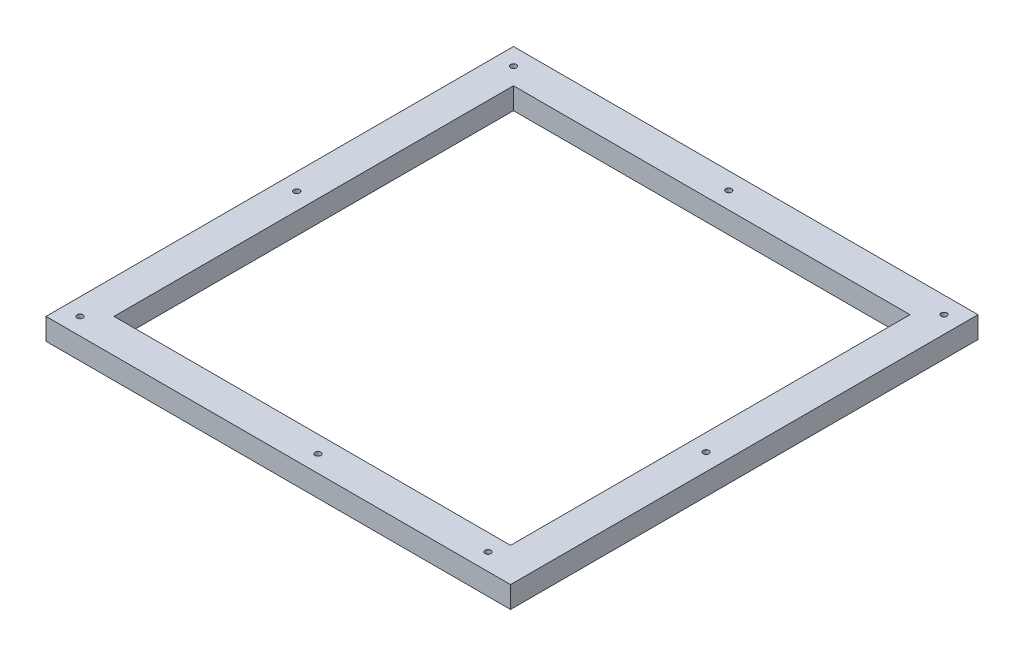
ISO-10303-21;
HEADER;
FILE_DESCRIPTION(('STEP AP214'),'2;1');
FILE_NAME('part.step','',(''),(''),'','','');
FILE_SCHEMA(('AUTOMOTIVE_DESIGN { 1 0 10303 214 1 1 1 1 }'));
ENDSEC;
DATA;
#1=APPLICATION_CONTEXT('core data for automotive mechanical design processes');
#2=APPLICATION_PROTOCOL_DEFINITION('international standard','automotive_design',2000,#1);
#3=PRODUCT_CONTEXT('',#1,'mechanical');
#4=PRODUCT('Part','Part','',(#3));
#5=PRODUCT_RELATED_PRODUCT_CATEGORY('part','',(#4));
#6=PRODUCT_DEFINITION_FORMATION('','',#4);
#7=PRODUCT_DEFINITION_CONTEXT('part definition',#1,'design');
#8=PRODUCT_DEFINITION('design','',#6,#7);
#9=PRODUCT_DEFINITION_SHAPE('','',#8);
#10=(LENGTH_UNIT() NAMED_UNIT(*) SI_UNIT(.MILLI.,.METRE.));
#11=(NAMED_UNIT(*) PLANE_ANGLE_UNIT() SI_UNIT($,.RADIAN.));
#12=(NAMED_UNIT(*) SI_UNIT($,.STERADIAN.) SOLID_ANGLE_UNIT());
#13=UNCERTAINTY_MEASURE_WITH_UNIT(LENGTH_MEASURE(1.E-05),#10,'distance_accuracy_value','');
#14=(GEOMETRIC_REPRESENTATION_CONTEXT(3) GLOBAL_UNCERTAINTY_ASSIGNED_CONTEXT((#13)) GLOBAL_UNIT_ASSIGNED_CONTEXT((#10,
#11,#12)) REPRESENTATION_CONTEXT('',''));
#15=CARTESIAN_POINT('',(0.,0.,0.));
#16=DIRECTION('',(0.,0.,1.));
#17=DIRECTION('',(1.,0.,0.));
#18=AXIS2_PLACEMENT_3D('',#15,#16,#17);
#19=CARTESIAN_POINT('',(136.635,12.7,-137.5));
#20=DIRECTION('',(-1.,0.,0.));
#21=DIRECTION('',(0.,0.,1.));
#22=AXIS2_PLACEMENT_3D('',#19,#20,#21);
#23=PLANE('',#22);
#24=DIRECTION('',(0.,0.,-1.));
#25=VECTOR('',#24,1.);
#26=CARTESIAN_POINT('',(136.635,0.,-137.5));
#27=LINE('',#26,#25);
#28=CARTESIAN_POINT('',(136.635,0.,137.5));
#29=VERTEX_POINT('',#28);
#30=CARTESIAN_POINT('',(136.635,0.,-137.5));
#31=VERTEX_POINT('',#30);
#32=EDGE_CURVE('E155',#29,#31,#27,.T.);
#33=ORIENTED_EDGE('',*,*,#32,.T.);
#34=DIRECTION('',(0.,-1.,0.));
#35=VECTOR('',#34,1.);
#36=CARTESIAN_POINT('',(136.635,12.7,-137.5));
#37=LINE('',#36,#35);
#38=CARTESIAN_POINT('',(136.635,12.7,-137.5));
#39=VERTEX_POINT('',#38);
#40=EDGE_CURVE('E11',#39,#31,#37,.T.);
#41=ORIENTED_EDGE('',*,*,#40,.F.);
#42=DIRECTION('',(0.,0.,-1.));
#43=VECTOR('',#42,1.);
#44=CARTESIAN_POINT('',(136.635,12.7,-137.5));
#45=LINE('',#44,#43);
#46=CARTESIAN_POINT('',(136.635,12.7,137.5));
#47=VERTEX_POINT('',#46);
#48=EDGE_CURVE('E161',#47,#39,#45,.T.);
#49=ORIENTED_EDGE('',*,*,#48,.F.);
#50=DIRECTION('',(0.,-1.,0.));
#51=VECTOR('',#50,1.);
#52=CARTESIAN_POINT('',(136.635,12.7,137.5));
#53=LINE('',#52,#51);
#54=EDGE_CURVE('E175',#47,#29,#53,.T.);
#55=ORIENTED_EDGE('',*,*,#54,.T.);
#56=EDGE_LOOP('',(#33,#41,#49,#55));
#57=FACE_BOUND('',#56,.T.);
#58=ADVANCED_FACE('F44',(#57),#23,.F.);
#59=CARTESIAN_POINT('',(-136.635,12.7,-137.5));
#60=DIRECTION('',(0.,0.,1.));
#61=DIRECTION('',(1.,0.,0.));
#62=AXIS2_PLACEMENT_3D('',#59,#60,#61);
#63=PLANE('',#62);
#64=DIRECTION('',(-1.,0.,0.));
#65=VECTOR('',#64,1.);
#66=CARTESIAN_POINT('',(-136.635,0.,-137.5));
#67=LINE('',#66,#65);
#68=CARTESIAN_POINT('',(-136.635,0.,-137.5));
#69=VERTEX_POINT('',#68);
#70=EDGE_CURVE('E179',#31,#69,#67,.T.);
#71=ORIENTED_EDGE('',*,*,#70,.T.);
#72=DIRECTION('',(0.,-1.,0.));
#73=VECTOR('',#72,1.);
#74=CARTESIAN_POINT('',(-136.635,12.7,-137.5));
#75=LINE('',#74,#73);
#76=CARTESIAN_POINT('',(-136.635,12.7,-137.5));
#77=VERTEX_POINT('',#76);
#78=EDGE_CURVE('E52',#77,#69,#75,.T.);
#79=ORIENTED_EDGE('',*,*,#78,.F.);
#80=DIRECTION('',(-1.,0.,0.));
#81=VECTOR('',#80,1.);
#82=CARTESIAN_POINT('',(-136.635,12.7,-137.5));
#83=LINE('',#82,#81);
#84=EDGE_CURVE('E165',#39,#77,#83,.T.);
#85=ORIENTED_EDGE('',*,*,#84,.F.);
#86=ORIENTED_EDGE('',*,*,#40,.T.);
#87=EDGE_LOOP('',(#71,#79,#85,#86));
#88=FACE_BOUND('',#87,.T.);
#89=ADVANCED_FACE('F213',(#88),#63,.F.);
#90=CARTESIAN_POINT('',(-136.635,12.7,-137.5));
#91=DIRECTION('',(1.,0.,0.));
#92=DIRECTION('',(0.,0.,-1.));
#93=AXIS2_PLACEMENT_3D('',#90,#91,#92);
#94=PLANE('',#93);
#95=DIRECTION('',(0.,0.,1.));
#96=VECTOR('',#95,1.);
#97=CARTESIAN_POINT('',(-136.635,0.,-137.5));
#98=LINE('',#97,#96);
#99=CARTESIAN_POINT('',(-136.635,0.,137.5));
#100=VERTEX_POINT('',#99);
#101=EDGE_CURVE('E182',#69,#100,#98,.T.);
#102=ORIENTED_EDGE('',*,*,#101,.T.);
#103=DIRECTION('',(0.,-1.,0.));
#104=VECTOR('',#103,1.);
#105=CARTESIAN_POINT('',(-136.635,12.7,137.5));
#106=LINE('',#105,#104);
#107=CARTESIAN_POINT('',(-136.635,12.7,137.5));
#108=VERTEX_POINT('',#107);
#109=EDGE_CURVE('E190',#108,#100,#106,.T.);
#110=ORIENTED_EDGE('',*,*,#109,.F.);
#111=DIRECTION('',(0.,0.,1.));
#112=VECTOR('',#111,1.);
#113=CARTESIAN_POINT('',(-136.635,12.7,-137.5));
#114=LINE('',#113,#112);
#115=EDGE_CURVE('E169',#77,#108,#114,.T.);
#116=ORIENTED_EDGE('',*,*,#115,.F.);
#117=ORIENTED_EDGE('',*,*,#78,.T.);
#118=EDGE_LOOP('',(#102,#110,#116,#117));
#119=FACE_BOUND('',#118,.T.);
#120=ADVANCED_FACE('F199',(#119),#94,.F.);
#121=CARTESIAN_POINT('',(-136.635,12.7,137.5));
#122=DIRECTION('',(0.,0.,-1.));
#123=DIRECTION('',(-1.,0.,0.));
#124=AXIS2_PLACEMENT_3D('',#121,#122,#123);
#125=PLANE('',#124);
#126=DIRECTION('',(1.,0.,0.));
#127=VECTOR('',#126,1.);
#128=CARTESIAN_POINT('',(-136.635,0.,137.5));
#129=LINE('',#128,#127);
#130=EDGE_CURVE('E166',#100,#29,#129,.T.);
#131=ORIENTED_EDGE('',*,*,#130,.T.);
#132=ORIENTED_EDGE('',*,*,#54,.F.);
#133=DIRECTION('',(1.,0.,0.));
#134=VECTOR('',#133,1.);
#135=CARTESIAN_POINT('',(-136.635,12.7,137.5));
#136=LINE('',#135,#134);
#137=EDGE_CURVE('E172',#108,#47,#136,.T.);
#138=ORIENTED_EDGE('',*,*,#137,.F.);
#139=ORIENTED_EDGE('',*,*,#109,.T.);
#140=EDGE_LOOP('',(#131,#132,#138,#139));
#141=FACE_BOUND('',#140,.T.);
#142=ADVANCED_FACE('F206',(#141),#125,.F.);
#143=CARTESIAN_POINT('',(0.,12.7,0.));
#144=DIRECTION('',(0.,1.,0.));
#145=DIRECTION('',(0.,0.,1.));
#146=AXIS2_PLACEMENT_3D('',#143,#144,#145);
#147=PLANE('',#146);
#148=CARTESIAN_POINT('',(-126.631099999995,12.7,127.5));
#149=DIRECTION('',(0.,1.,0.));
#150=DIRECTION('',(0.,0.,1.));
#151=AXIS2_PLACEMENT_3D('',#148,#149,#150);
#152=CIRCLE('',#151,1.725);
#153=CARTESIAN_POINT('',(-126.631099999995,12.7,129.225));
#154=VERTEX_POINT('',#153);
#155=EDGE_CURVE('E311',#154,#154,#152,.T.);
#156=ORIENTED_EDGE('',*,*,#155,.F.);
#157=EDGE_LOOP('',(#156));
#158=FACE_BOUND('',#157,.T.);
#159=CARTESIAN_POINT('',(0.,12.7,-127.5));
#160=DIRECTION('',(0.,1.,0.));
#161=DIRECTION('',(0.,0.,1.));
#162=AXIS2_PLACEMENT_3D('',#159,#160,#161);
#163=CIRCLE('',#162,1.725);
#164=CARTESIAN_POINT('',(0.,12.7,-125.775));
#165=VERTEX_POINT('',#164);
#166=EDGE_CURVE('E321',#165,#165,#163,.T.);
#167=ORIENTED_EDGE('',*,*,#166,.F.);
#168=EDGE_LOOP('',(#167));
#169=FACE_BOUND('',#168,.T.);
#170=CARTESIAN_POINT('',(-126.635,12.7,-127.5));
#171=DIRECTION('',(0.,1.,0.));
#172=DIRECTION('',(0.,0.,1.));
#173=AXIS2_PLACEMENT_3D('',#170,#171,#172);
#174=CIRCLE('',#173,1.725);
#175=CARTESIAN_POINT('',(-126.635,12.7,-125.775));
#176=VERTEX_POINT('',#175);
#177=EDGE_CURVE('E333',#176,#176,#174,.T.);
#178=ORIENTED_EDGE('',*,*,#177,.F.);
#179=EDGE_LOOP('',(#178));
#180=FACE_BOUND('',#179,.T.);
#181=CARTESIAN_POINT('',(126.632800000004,12.7,-127.5));
#182=DIRECTION('',(0.,1.,0.));
#183=DIRECTION('',(0.,0.,1.));
#184=AXIS2_PLACEMENT_3D('',#181,#182,#183);
#185=CIRCLE('',#184,1.725);
#186=CARTESIAN_POINT('',(126.632800000004,12.7,-125.775));
#187=VERTEX_POINT('',#186);
#188=EDGE_CURVE('E345',#187,#187,#185,.T.);
#189=ORIENTED_EDGE('',*,*,#188,.F.);
#190=EDGE_LOOP('',(#189));
#191=FACE_BOUND('',#190,.T.);
#192=CARTESIAN_POINT('',(-126.635,12.7,0.));
#193=DIRECTION('',(0.,1.,0.));
#194=DIRECTION('',(0.,0.,1.));
#195=AXIS2_PLACEMENT_3D('',#192,#193,#194);
#196=CIRCLE('',#195,1.725);
#197=CARTESIAN_POINT('',(-126.635,12.7,1.72500000000009));
#198=VERTEX_POINT('',#197);
#199=EDGE_CURVE('E357',#198,#198,#196,.T.);
#200=ORIENTED_EDGE('',*,*,#199,.F.);
#201=EDGE_LOOP('',(#200));
#202=FACE_BOUND('',#201,.T.);
#203=CARTESIAN_POINT('',(13.3689000000046,12.7,127.5));
#204=DIRECTION('',(0.,1.,0.));
#205=DIRECTION('',(0.,0.,1.));
#206=AXIS2_PLACEMENT_3D('',#203,#204,#205);
#207=CIRCLE('',#206,1.725);
#208=CARTESIAN_POINT('',(13.3689000000046,12.7,129.225));
#209=VERTEX_POINT('',#208);
#210=EDGE_CURVE('E369',#209,#209,#207,.T.);
#211=ORIENTED_EDGE('',*,*,#210,.F.);
#212=EDGE_LOOP('',(#211));
#213=FACE_BOUND('',#212,.T.);
#214=CARTESIAN_POINT('',(113.368900000005,12.7,127.500000000001));
#215=DIRECTION('',(0.,1.,0.));
#216=DIRECTION('',(0.,0.,1.));
#217=AXIS2_PLACEMENT_3D('',#214,#215,#216);
#218=CIRCLE('',#217,1.725);
#219=CARTESIAN_POINT('',(113.368900000005,12.7,129.225000000001));
#220=VERTEX_POINT('',#219);
#221=EDGE_CURVE('E381',#220,#220,#218,.T.);
#222=ORIENTED_EDGE('',*,*,#221,.F.);
#223=EDGE_LOOP('',(#222));
#224=FACE_BOUND('',#223,.T.);
#225=CARTESIAN_POINT('',(126.632800000004,12.7,12.5));
#226=DIRECTION('',(0.,1.,0.));
#227=DIRECTION('',(0.,0.,1.));
#228=AXIS2_PLACEMENT_3D('',#225,#226,#227);
#229=CIRCLE('',#228,1.725);
#230=CARTESIAN_POINT('',(126.632800000004,12.7,14.225));
#231=VERTEX_POINT('',#230);
#232=EDGE_CURVE('E393',#231,#231,#229,.T.);
#233=ORIENTED_EDGE('',*,*,#232,.F.);
#234=EDGE_LOOP('',(#233));
#235=FACE_BOUND('',#234,.T.);
#236=DIRECTION('',(0.,0.,-1.));
#237=VECTOR('',#236,1.);
#238=CARTESIAN_POINT('',(116.635,12.7,-117.5));
#239=LINE('',#238,#237);
#240=CARTESIAN_POINT('',(116.635,12.7,117.5));
#241=VERTEX_POINT('',#240);
#242=CARTESIAN_POINT('',(116.635,12.7,-117.5));
#243=VERTEX_POINT('',#242);
#244=EDGE_CURVE('E59',#241,#243,#239,.T.);
#245=ORIENTED_EDGE('',*,*,#244,.F.);
#246=DIRECTION('',(1.,0.,0.));
#247=VECTOR('',#246,1.);
#248=CARTESIAN_POINT('',(-116.635,12.7,117.5));
#249=LINE('',#248,#247);
#250=CARTESIAN_POINT('',(-116.635,12.7,117.5));
#251=VERTEX_POINT('',#250);
#252=EDGE_CURVE('E130',#251,#241,#249,.T.);
#253=ORIENTED_EDGE('',*,*,#252,.F.);
#254=DIRECTION('',(0.,0.,1.));
#255=VECTOR('',#254,1.);
#256=CARTESIAN_POINT('',(-116.635,12.7,-117.5));
#257=LINE('',#256,#255);
#258=CARTESIAN_POINT('',(-116.635,12.7,-117.5));
#259=VERTEX_POINT('',#258);
#260=EDGE_CURVE('E134',#259,#251,#257,.T.);
#261=ORIENTED_EDGE('',*,*,#260,.F.);
#262=DIRECTION('',(-1.,0.,0.));
#263=VECTOR('',#262,1.);
#264=CARTESIAN_POINT('',(-116.635,12.7,-117.5));
#265=LINE('',#264,#263);
#266=EDGE_CURVE('E146',#243,#259,#265,.T.);
#267=ORIENTED_EDGE('',*,*,#266,.F.);
#268=EDGE_LOOP('',(#245,#253,#261,#267));
#269=FACE_BOUND('',#268,.T.);
#270=ORIENTED_EDGE('',*,*,#48,.T.);
#271=ORIENTED_EDGE('',*,*,#84,.T.);
#272=ORIENTED_EDGE('',*,*,#115,.T.);
#273=ORIENTED_EDGE('',*,*,#137,.T.);
#274=EDGE_LOOP('',(#270,#271,#272,#273));
#275=FACE_BOUND('',#274,.T.);
#276=ADVANCED_FACE('F212',(#158,#169,#180,#191,#202,#213,#224,#235,#269,#275),#147,.T.);
#277=CARTESIAN_POINT('',(0.,0.,0.));
#278=DIRECTION('',(0.,1.,0.));
#279=DIRECTION('',(0.,0.,1.));
#280=AXIS2_PLACEMENT_3D('',#277,#278,#279);
#281=PLANE('',#280);
#282=CARTESIAN_POINT('',(-126.631099999995,0.,127.5));
#283=DIRECTION('',(0.,1.,0.));
#284=DIRECTION('',(0.,0.,1.));
#285=AXIS2_PLACEMENT_3D('',#282,#283,#284);
#286=CIRCLE('',#285,1.69999999999999);
#287=CARTESIAN_POINT('',(-126.631099999995,0.,129.2));
#288=VERTEX_POINT('',#287);
#289=EDGE_CURVE('E315',#288,#288,#286,.T.);
#290=ORIENTED_EDGE('',*,*,#289,.T.);
#291=EDGE_LOOP('',(#290));
#292=FACE_BOUND('',#291,.T.);
#293=CARTESIAN_POINT('',(0.,0.,-127.5));
#294=DIRECTION('',(0.,1.,0.));
#295=DIRECTION('',(0.,0.,1.));
#296=AXIS2_PLACEMENT_3D('',#293,#294,#295);
#297=CIRCLE('',#296,1.7);
#298=CARTESIAN_POINT('',(0.,0.,-125.8));
#299=VERTEX_POINT('',#298);
#300=EDGE_CURVE('E329',#299,#299,#297,.T.);
#301=ORIENTED_EDGE('',*,*,#300,.T.);
#302=EDGE_LOOP('',(#301));
#303=FACE_BOUND('',#302,.T.);
#304=CARTESIAN_POINT('',(-126.635,0.,-127.5));
#305=DIRECTION('',(0.,1.,0.));
#306=DIRECTION('',(0.,0.,1.));
#307=AXIS2_PLACEMENT_3D('',#304,#305,#306);
#308=CIRCLE('',#307,1.69999999999999);
#309=CARTESIAN_POINT('',(-126.635,0.,-125.8));
#310=VERTEX_POINT('',#309);
#311=EDGE_CURVE('E341',#310,#310,#308,.T.);
#312=ORIENTED_EDGE('',*,*,#311,.T.);
#313=EDGE_LOOP('',(#312));
#314=FACE_BOUND('',#313,.T.);
#315=CARTESIAN_POINT('',(126.632800000004,0.,-127.5));
#316=DIRECTION('',(0.,1.,0.));
#317=DIRECTION('',(0.,0.,1.));
#318=AXIS2_PLACEMENT_3D('',#315,#316,#317);
#319=CIRCLE('',#318,1.70000000000001);
#320=CARTESIAN_POINT('',(126.632800000004,0.,-125.8));
#321=VERTEX_POINT('',#320);
#322=EDGE_CURVE('E353',#321,#321,#319,.T.);
#323=ORIENTED_EDGE('',*,*,#322,.T.);
#324=EDGE_LOOP('',(#323));
#325=FACE_BOUND('',#324,.T.);
#326=CARTESIAN_POINT('',(-126.635,0.,0.));
#327=DIRECTION('',(0.,1.,0.));
#328=DIRECTION('',(0.,0.,1.));
#329=AXIS2_PLACEMENT_3D('',#326,#327,#328);
#330=CIRCLE('',#329,1.69999999999999);
#331=CARTESIAN_POINT('',(-126.635,0.,1.70000000000008));
#332=VERTEX_POINT('',#331);
#333=EDGE_CURVE('E365',#332,#332,#330,.T.);
#334=ORIENTED_EDGE('',*,*,#333,.T.);
#335=EDGE_LOOP('',(#334));
#336=FACE_BOUND('',#335,.T.);
#337=CARTESIAN_POINT('',(13.3689000000046,0.,127.5));
#338=DIRECTION('',(0.,1.,0.));
#339=DIRECTION('',(0.,0.,1.));
#340=AXIS2_PLACEMENT_3D('',#337,#338,#339);
#341=CIRCLE('',#340,1.7);
#342=CARTESIAN_POINT('',(13.3689000000046,0.,129.2));
#343=VERTEX_POINT('',#342);
#344=EDGE_CURVE('E377',#343,#343,#341,.T.);
#345=ORIENTED_EDGE('',*,*,#344,.T.);
#346=EDGE_LOOP('',(#345));
#347=FACE_BOUND('',#346,.T.);
#348=CARTESIAN_POINT('',(113.368900000005,0.,127.500000000001));
#349=DIRECTION('',(0.,1.,0.));
#350=DIRECTION('',(0.,0.,1.));
#351=AXIS2_PLACEMENT_3D('',#348,#349,#350);
#352=CIRCLE('',#351,1.69999999999999);
#353=CARTESIAN_POINT('',(113.368900000005,0.,129.200000000001));
#354=VERTEX_POINT('',#353);
#355=EDGE_CURVE('E389',#354,#354,#352,.T.);
#356=ORIENTED_EDGE('',*,*,#355,.T.);
#357=EDGE_LOOP('',(#356));
#358=FACE_BOUND('',#357,.T.);
#359=CARTESIAN_POINT('',(126.632800000004,0.,12.5));
#360=DIRECTION('',(0.,1.,0.));
#361=DIRECTION('',(0.,0.,1.));
#362=AXIS2_PLACEMENT_3D('',#359,#360,#361);
#363=CIRCLE('',#362,1.70000000000001);
#364=CARTESIAN_POINT('',(126.632800000004,0.,14.2));
#365=VERTEX_POINT('',#364);
#366=EDGE_CURVE('E137',#365,#365,#363,.T.);
#367=ORIENTED_EDGE('',*,*,#366,.T.);
#368=EDGE_LOOP('',(#367));
#369=FACE_BOUND('',#368,.T.);
#370=DIRECTION('',(1.,0.,0.));
#371=VECTOR('',#370,1.);
#372=CARTESIAN_POINT('',(-116.635,0.,117.5));
#373=LINE('',#372,#371);
#374=CARTESIAN_POINT('',(-116.635,0.,117.5));
#375=VERTEX_POINT('',#374);
#376=CARTESIAN_POINT('',(116.635,0.,117.5));
#377=VERTEX_POINT('',#376);
#378=EDGE_CURVE('E118',#375,#377,#373,.T.);
#379=ORIENTED_EDGE('',*,*,#378,.T.);
#380=DIRECTION('',(0.,0.,-1.));
#381=VECTOR('',#380,1.);
#382=CARTESIAN_POINT('',(116.635,0.,-117.5));
#383=LINE('',#382,#381);
#384=CARTESIAN_POINT('',(116.635,0.,-117.5));
#385=VERTEX_POINT('',#384);
#386=EDGE_CURVE('E111',#377,#385,#383,.T.);
#387=ORIENTED_EDGE('',*,*,#386,.T.);
#388=DIRECTION('',(-1.,0.,0.));
#389=VECTOR('',#388,1.);
#390=CARTESIAN_POINT('',(-116.635,0.,-117.5));
#391=LINE('',#390,#389);
#392=CARTESIAN_POINT('',(-116.635,0.,-117.5));
#393=VERTEX_POINT('',#392);
#394=EDGE_CURVE('E121',#385,#393,#391,.T.);
#395=ORIENTED_EDGE('',*,*,#394,.T.);
#396=DIRECTION('',(0.,0.,1.));
#397=VECTOR('',#396,1.);
#398=CARTESIAN_POINT('',(-116.635,0.,-117.5));
#399=LINE('',#398,#397);
#400=EDGE_CURVE('E67',#393,#375,#399,.T.);
#401=ORIENTED_EDGE('',*,*,#400,.T.);
#402=EDGE_LOOP('',(#379,#387,#395,#401));
#403=FACE_BOUND('',#402,.T.);
#404=ORIENTED_EDGE('',*,*,#32,.F.);
#405=ORIENTED_EDGE('',*,*,#130,.F.);
#406=ORIENTED_EDGE('',*,*,#101,.F.);
#407=ORIENTED_EDGE('',*,*,#70,.F.);
#408=EDGE_LOOP('',(#404,#405,#406,#407));
#409=FACE_BOUND('',#408,.T.);
#410=ADVANCED_FACE('F126',(#292,#303,#314,#325,#336,#347,#358,#369,#403,#409),#281,.F.);
#411=CARTESIAN_POINT('',(116.635,0.,-117.5));
#412=DIRECTION('',(1.,0.,0.));
#413=DIRECTION('',(0.,0.,-1.));
#414=AXIS2_PLACEMENT_3D('',#411,#412,#413);
#415=PLANE('',#414);
#416=ORIENTED_EDGE('',*,*,#244,.T.);
#417=DIRECTION('',(0.,1.,0.));
#418=VECTOR('',#417,1.);
#419=CARTESIAN_POINT('',(116.635,0.,-117.5));
#420=LINE('',#419,#418);
#421=EDGE_CURVE('E107',#385,#243,#420,.T.);
#422=ORIENTED_EDGE('',*,*,#421,.F.);
#423=ORIENTED_EDGE('',*,*,#386,.F.);
#424=DIRECTION('',(0.,1.,0.));
#425=VECTOR('',#424,1.);
#426=CARTESIAN_POINT('',(116.635,0.,117.5));
#427=LINE('',#426,#425);
#428=EDGE_CURVE('E152',#377,#241,#427,.T.);
#429=ORIENTED_EDGE('',*,*,#428,.T.);
#430=EDGE_LOOP('',(#416,#422,#423,#429));
#431=FACE_BOUND('',#430,.T.);
#432=ADVANCED_FACE('F109',(#431),#415,.F.);
#433=CARTESIAN_POINT('',(-116.635,0.,117.5));
#434=DIRECTION('',(0.,0.,1.));
#435=DIRECTION('',(1.,0.,0.));
#436=AXIS2_PLACEMENT_3D('',#433,#434,#435);
#437=PLANE('',#436);
#438=ORIENTED_EDGE('',*,*,#252,.T.);
#439=ORIENTED_EDGE('',*,*,#428,.F.);
#440=ORIENTED_EDGE('',*,*,#378,.F.);
#441=DIRECTION('',(0.,1.,0.));
#442=VECTOR('',#441,1.);
#443=CARTESIAN_POINT('',(-116.635,0.,117.5));
#444=LINE('',#443,#442);
#445=EDGE_CURVE('E156',#375,#251,#444,.T.);
#446=ORIENTED_EDGE('',*,*,#445,.T.);
#447=EDGE_LOOP('',(#438,#439,#440,#446));
#448=FACE_BOUND('',#447,.T.);
#449=ADVANCED_FACE('F231',(#448),#437,.F.);
#450=CARTESIAN_POINT('',(-116.635,0.,-117.5));
#451=DIRECTION('',(-1.,0.,0.));
#452=DIRECTION('',(0.,0.,1.));
#453=AXIS2_PLACEMENT_3D('',#450,#451,#452);
#454=PLANE('',#453);
#455=ORIENTED_EDGE('',*,*,#260,.T.);
#456=ORIENTED_EDGE('',*,*,#445,.F.);
#457=ORIENTED_EDGE('',*,*,#400,.F.);
#458=DIRECTION('',(0.,1.,0.));
#459=VECTOR('',#458,1.);
#460=CARTESIAN_POINT('',(-116.635,0.,-117.5));
#461=LINE('',#460,#459);
#462=EDGE_CURVE('E117',#393,#259,#461,.T.);
#463=ORIENTED_EDGE('',*,*,#462,.T.);
#464=EDGE_LOOP('',(#455,#456,#457,#463));
#465=FACE_BOUND('',#464,.T.);
#466=ADVANCED_FACE('F235',(#465),#454,.F.);
#467=CARTESIAN_POINT('',(-116.635,0.,-117.5));
#468=DIRECTION('',(0.,0.,-1.));
#469=DIRECTION('',(-1.,0.,0.));
#470=AXIS2_PLACEMENT_3D('',#467,#468,#469);
#471=PLANE('',#470);
#472=ORIENTED_EDGE('',*,*,#266,.T.);
#473=ORIENTED_EDGE('',*,*,#462,.F.);
#474=ORIENTED_EDGE('',*,*,#394,.F.);
#475=ORIENTED_EDGE('',*,*,#421,.T.);
#476=EDGE_LOOP('',(#472,#473,#474,#475));
#477=FACE_BOUND('',#476,.T.);
#478=ADVANCED_FACE('F122',(#477),#471,.F.);
#479=CARTESIAN_POINT('',(126.632800000004,12.7,12.5));
#480=DIRECTION('',(0.,1.,0.));
#481=DIRECTION('',(0.,0.,1.));
#482=AXIS2_PLACEMENT_3D('',#479,#480,#481);
#483=CYLINDRICAL_SURFACE('',#482,1.70000000000001);
#484=ORIENTED_EDGE('',*,*,#366,.F.);
#485=EDGE_LOOP('',(#484));
#486=FACE_BOUND('',#485,.T.);
#487=CARTESIAN_POINT('',(126.632800000004,12.675,12.5));
#488=DIRECTION('',(0.,1.,0.));
#489=DIRECTION('',(0.,0.,1.));
#490=AXIS2_PLACEMENT_3D('',#487,#488,#489);
#491=CIRCLE('',#490,1.70000000000001);
#492=CARTESIAN_POINT('',(126.632800000004,12.675,14.2));
#493=VERTEX_POINT('',#492);
#494=EDGE_CURVE('E396',#493,#493,#491,.T.);
#495=ORIENTED_EDGE('',*,*,#494,.T.);
#496=EDGE_LOOP('',(#495));
#497=FACE_BOUND('',#496,.T.);
#498=ADVANCED_FACE('F234',(#486,#497),#483,.F.);
#499=CARTESIAN_POINT('',(126.632800000004,12.7,12.5));
#500=DIRECTION('',(0.,1.,0.));
#501=DIRECTION('',(0.,0.,1.));
#502=AXIS2_PLACEMENT_3D('',#499,#500,#501);
#503=CONICAL_SURFACE('',#502,1.725,0.785398163397344);
#504=ORIENTED_EDGE('',*,*,#494,.F.);
#505=EDGE_LOOP('',(#504));
#506=FACE_BOUND('',#505,.T.);
#507=ORIENTED_EDGE('',*,*,#232,.T.);
#508=EDGE_LOOP('',(#507));
#509=FACE_BOUND('',#508,.T.);
#510=ADVANCED_FACE('F243',(#506,#509),#503,.F.);
#511=CARTESIAN_POINT('',(113.368900000005,12.7,127.500000000001));
#512=DIRECTION('',(0.,1.,0.));
#513=DIRECTION('',(0.,0.,1.));
#514=AXIS2_PLACEMENT_3D('',#511,#512,#513);
#515=CYLINDRICAL_SURFACE('',#514,1.69999999999999);
#516=ORIENTED_EDGE('',*,*,#355,.F.);
#517=EDGE_LOOP('',(#516));
#518=FACE_BOUND('',#517,.T.);
#519=CARTESIAN_POINT('',(113.368900000005,12.675,127.500000000001));
#520=DIRECTION('',(0.,1.,0.));
#521=DIRECTION('',(0.,0.,1.));
#522=AXIS2_PLACEMENT_3D('',#519,#520,#521);
#523=CIRCLE('',#522,1.69999999999999);
#524=CARTESIAN_POINT('',(113.368900000005,12.675,129.200000000001));
#525=VERTEX_POINT('',#524);
#526=EDGE_CURVE('E385',#525,#525,#523,.T.);
#527=ORIENTED_EDGE('',*,*,#526,.T.);
#528=EDGE_LOOP('',(#527));
#529=FACE_BOUND('',#528,.T.);
#530=ADVANCED_FACE('F247',(#518,#529),#515,.F.);
#531=CARTESIAN_POINT('',(113.368900000005,12.7,127.500000000001));
#532=DIRECTION('',(0.,1.,0.));
#533=DIRECTION('',(0.,0.,1.));
#534=AXIS2_PLACEMENT_3D('',#531,#532,#533);
#535=CONICAL_SURFACE('',#534,1.725,0.785398163397622);
#536=ORIENTED_EDGE('',*,*,#526,.F.);
#537=EDGE_LOOP('',(#536));
#538=FACE_BOUND('',#537,.T.);
#539=ORIENTED_EDGE('',*,*,#221,.T.);
#540=EDGE_LOOP('',(#539));
#541=FACE_BOUND('',#540,.T.);
#542=ADVANCED_FACE('F251',(#538,#541),#535,.F.);
#543=CARTESIAN_POINT('',(13.3689000000046,12.7,127.5));
#544=DIRECTION('',(0.,1.,0.));
#545=DIRECTION('',(0.,0.,1.));
#546=AXIS2_PLACEMENT_3D('',#543,#544,#545);
#547=CYLINDRICAL_SURFACE('',#546,1.7);
#548=ORIENTED_EDGE('',*,*,#344,.F.);
#549=EDGE_LOOP('',(#548));
#550=FACE_BOUND('',#549,.T.);
#551=CARTESIAN_POINT('',(13.3689000000046,12.675,127.5));
#552=DIRECTION('',(0.,1.,0.));
#553=DIRECTION('',(0.,0.,1.));
#554=AXIS2_PLACEMENT_3D('',#551,#552,#553);
#555=CIRCLE('',#554,1.7);
#556=CARTESIAN_POINT('',(13.3689000000046,12.675,129.2));
#557=VERTEX_POINT('',#556);
#558=EDGE_CURVE('E373',#557,#557,#555,.T.);
#559=ORIENTED_EDGE('',*,*,#558,.T.);
#560=EDGE_LOOP('',(#559));
#561=FACE_BOUND('',#560,.T.);
#562=ADVANCED_FACE('F255',(#550,#561),#547,.F.);
#563=CARTESIAN_POINT('',(13.3689000000046,12.7,127.5));
#564=DIRECTION('',(0.,1.,0.));
#565=DIRECTION('',(0.,0.,1.));
#566=AXIS2_PLACEMENT_3D('',#563,#564,#565);
#567=CONICAL_SURFACE('',#566,1.725,0.785398163397414);
#568=ORIENTED_EDGE('',*,*,#558,.F.);
#569=EDGE_LOOP('',(#568));
#570=FACE_BOUND('',#569,.T.);
#571=ORIENTED_EDGE('',*,*,#210,.T.);
#572=EDGE_LOOP('',(#571));
#573=FACE_BOUND('',#572,.T.);
#574=ADVANCED_FACE('F259',(#570,#573),#567,.F.);
#575=CARTESIAN_POINT('',(-126.635,12.7,0.));
#576=DIRECTION('',(0.,1.,0.));
#577=DIRECTION('',(0.,0.,1.));
#578=AXIS2_PLACEMENT_3D('',#575,#576,#577);
#579=CYLINDRICAL_SURFACE('',#578,1.69999999999999);
#580=ORIENTED_EDGE('',*,*,#333,.F.);
#581=EDGE_LOOP('',(#580));
#582=FACE_BOUND('',#581,.T.);
#583=CARTESIAN_POINT('',(-126.635,12.675,0.));
#584=DIRECTION('',(0.,1.,0.));
#585=DIRECTION('',(0.,0.,1.));
#586=AXIS2_PLACEMENT_3D('',#583,#584,#585);
#587=CIRCLE('',#586,1.69999999999999);
#588=CARTESIAN_POINT('',(-126.635,12.675,1.70000000000008));
#589=VERTEX_POINT('',#588);
#590=EDGE_CURVE('E361',#589,#589,#587,.T.);
#591=ORIENTED_EDGE('',*,*,#590,.T.);
#592=EDGE_LOOP('',(#591));
#593=FACE_BOUND('',#592,.T.);
#594=ADVANCED_FACE('F263',(#582,#593),#579,.F.);
#595=CARTESIAN_POINT('',(-126.635,12.7,0.));
#596=DIRECTION('',(0.,1.,0.));
#597=DIRECTION('',(0.,0.,1.));
#598=AXIS2_PLACEMENT_3D('',#595,#596,#597);
#599=CONICAL_SURFACE('',#598,1.725,0.785398163397622);
#600=ORIENTED_EDGE('',*,*,#590,.F.);
#601=EDGE_LOOP('',(#600));
#602=FACE_BOUND('',#601,.T.);
#603=ORIENTED_EDGE('',*,*,#199,.T.);
#604=EDGE_LOOP('',(#603));
#605=FACE_BOUND('',#604,.T.);
#606=ADVANCED_FACE('F267',(#602,#605),#599,.F.);
#607=CARTESIAN_POINT('',(126.632800000004,12.7,-127.5));
#608=DIRECTION('',(0.,1.,0.));
#609=DIRECTION('',(0.,0.,1.));
#610=AXIS2_PLACEMENT_3D('',#607,#608,#609);
#611=CYLINDRICAL_SURFACE('',#610,1.70000000000001);
#612=ORIENTED_EDGE('',*,*,#322,.F.);
#613=EDGE_LOOP('',(#612));
#614=FACE_BOUND('',#613,.T.);
#615=CARTESIAN_POINT('',(126.632800000004,12.675,-127.5));
#616=DIRECTION('',(0.,1.,0.));
#617=DIRECTION('',(0.,0.,1.));
#618=AXIS2_PLACEMENT_3D('',#615,#616,#617);
#619=CIRCLE('',#618,1.70000000000001);
#620=CARTESIAN_POINT('',(126.632800000004,12.675,-125.8));
#621=VERTEX_POINT('',#620);
#622=EDGE_CURVE('E349',#621,#621,#619,.T.);
#623=ORIENTED_EDGE('',*,*,#622,.T.);
#624=EDGE_LOOP('',(#623));
#625=FACE_BOUND('',#624,.T.);
#626=ADVANCED_FACE('F271',(#614,#625),#611,.F.);
#627=CARTESIAN_POINT('',(126.632800000004,12.7,-127.5));
#628=DIRECTION('',(0.,1.,0.));
#629=DIRECTION('',(0.,0.,1.));
#630=AXIS2_PLACEMENT_3D('',#627,#628,#629);
#631=CONICAL_SURFACE('',#630,1.725,0.785398163397344);
#632=ORIENTED_EDGE('',*,*,#622,.F.);
#633=EDGE_LOOP('',(#632));
#634=FACE_BOUND('',#633,.T.);
#635=ORIENTED_EDGE('',*,*,#188,.T.);
#636=EDGE_LOOP('',(#635));
#637=FACE_BOUND('',#636,.T.);
#638=ADVANCED_FACE('F275',(#634,#637),#631,.F.);
#639=CARTESIAN_POINT('',(-126.635,12.7,-127.5));
#640=DIRECTION('',(0.,1.,0.));
#641=DIRECTION('',(0.,0.,1.));
#642=AXIS2_PLACEMENT_3D('',#639,#640,#641);
#643=CYLINDRICAL_SURFACE('',#642,1.69999999999999);
#644=ORIENTED_EDGE('',*,*,#311,.F.);
#645=EDGE_LOOP('',(#644));
#646=FACE_BOUND('',#645,.T.);
#647=CARTESIAN_POINT('',(-126.635,12.675,-127.5));
#648=DIRECTION('',(0.,1.,0.));
#649=DIRECTION('',(0.,0.,1.));
#650=AXIS2_PLACEMENT_3D('',#647,#648,#649);
#651=CIRCLE('',#650,1.69999999999999);
#652=CARTESIAN_POINT('',(-126.635,12.675,-125.8));
#653=VERTEX_POINT('',#652);
#654=EDGE_CURVE('E337',#653,#653,#651,.T.);
#655=ORIENTED_EDGE('',*,*,#654,.T.);
#656=EDGE_LOOP('',(#655));
#657=FACE_BOUND('',#656,.T.);
#658=ADVANCED_FACE('F279',(#646,#657),#643,.F.);
#659=CARTESIAN_POINT('',(-126.635,12.7,-127.5));
#660=DIRECTION('',(0.,1.,0.));
#661=DIRECTION('',(0.,0.,1.));
#662=AXIS2_PLACEMENT_3D('',#659,#660,#661);
#663=CONICAL_SURFACE('',#662,1.725,0.785398163397622);
#664=ORIENTED_EDGE('',*,*,#654,.F.);
#665=EDGE_LOOP('',(#664));
#666=FACE_BOUND('',#665,.T.);
#667=ORIENTED_EDGE('',*,*,#177,.T.);
#668=EDGE_LOOP('',(#667));
#669=FACE_BOUND('',#668,.T.);
#670=ADVANCED_FACE('F283',(#666,#669),#663,.F.);
#671=CARTESIAN_POINT('',(0.,12.7,-127.5));
#672=DIRECTION('',(0.,1.,0.));
#673=DIRECTION('',(0.,0.,1.));
#674=AXIS2_PLACEMENT_3D('',#671,#672,#673);
#675=CYLINDRICAL_SURFACE('',#674,1.7);
#676=ORIENTED_EDGE('',*,*,#300,.F.);
#677=EDGE_LOOP('',(#676));
#678=FACE_BOUND('',#677,.T.);
#679=CARTESIAN_POINT('',(0.,12.675,-127.5));
#680=DIRECTION('',(0.,1.,0.));
#681=DIRECTION('',(0.,0.,1.));
#682=AXIS2_PLACEMENT_3D('',#679,#680,#681);
#683=CIRCLE('',#682,1.7);
#684=CARTESIAN_POINT('',(0.,12.675,-125.8));
#685=VERTEX_POINT('',#684);
#686=EDGE_CURVE('E325',#685,#685,#683,.T.);
#687=ORIENTED_EDGE('',*,*,#686,.T.);
#688=EDGE_LOOP('',(#687));
#689=FACE_BOUND('',#688,.T.);
#690=ADVANCED_FACE('F287',(#678,#689),#675,.F.);
#691=CARTESIAN_POINT('',(0.,12.7,-127.5));
#692=DIRECTION('',(0.,1.,0.));
#693=DIRECTION('',(0.,0.,1.));
#694=AXIS2_PLACEMENT_3D('',#691,#692,#693);
#695=CONICAL_SURFACE('',#694,1.725,0.785398163397422);
#696=ORIENTED_EDGE('',*,*,#686,.F.);
#697=EDGE_LOOP('',(#696));
#698=FACE_BOUND('',#697,.T.);
#699=ORIENTED_EDGE('',*,*,#166,.T.);
#700=EDGE_LOOP('',(#699));
#701=FACE_BOUND('',#700,.T.);
#702=ADVANCED_FACE('F291',(#698,#701),#695,.F.);
#703=CARTESIAN_POINT('',(-126.631099999995,12.7,127.5));
#704=DIRECTION('',(0.,1.,0.));
#705=DIRECTION('',(0.,0.,1.));
#706=AXIS2_PLACEMENT_3D('',#703,#704,#705);
#707=CYLINDRICAL_SURFACE('',#706,1.69999999999999);
#708=ORIENTED_EDGE('',*,*,#289,.F.);
#709=EDGE_LOOP('',(#708));
#710=FACE_BOUND('',#709,.T.);
#711=CARTESIAN_POINT('',(-126.631099999995,12.675,127.5));
#712=DIRECTION('',(0.,1.,0.));
#713=DIRECTION('',(0.,0.,1.));
#714=AXIS2_PLACEMENT_3D('',#711,#712,#713);
#715=CIRCLE('',#714,1.69999999999999);
#716=CARTESIAN_POINT('',(-126.631099999995,12.675,129.2));
#717=VERTEX_POINT('',#716);
#718=EDGE_CURVE('E308',#717,#717,#715,.T.);
#719=ORIENTED_EDGE('',*,*,#718,.T.);
#720=EDGE_LOOP('',(#719));
#721=FACE_BOUND('',#720,.T.);
#722=ADVANCED_FACE('F295',(#710,#721),#707,.F.);
#723=CARTESIAN_POINT('',(-126.631099999995,12.7,127.5));
#724=DIRECTION('',(0.,1.,0.));
#725=DIRECTION('',(0.,0.,1.));
#726=AXIS2_PLACEMENT_3D('',#723,#724,#725);
#727=CONICAL_SURFACE('',#726,1.725,0.785398163397136);
#728=ORIENTED_EDGE('',*,*,#718,.F.);
#729=EDGE_LOOP('',(#728));
#730=FACE_BOUND('',#729,.T.);
#731=ORIENTED_EDGE('',*,*,#155,.T.);
#732=EDGE_LOOP('',(#731));
#733=FACE_BOUND('',#732,.T.);
#734=ADVANCED_FACE('F299',(#730,#733),#727,.F.);
#735=CLOSED_SHELL('',(#58,#89,#120,#142,#276,#410,#432,#449,#466,#478,#498,#510,#530,#542,#562,
#574,#594,#606,#626,#638,#658,#670,#690,#702,#722,#734));
#736=MANIFOLD_SOLID_BREP('B2',#735);
#737=ADVANCED_BREP_SHAPE_REPRESENTATION('',(#18,#736),#14);
#738=SHAPE_DEFINITION_REPRESENTATION(#9,#737);
ENDSEC;
END-ISO-10303-21;
